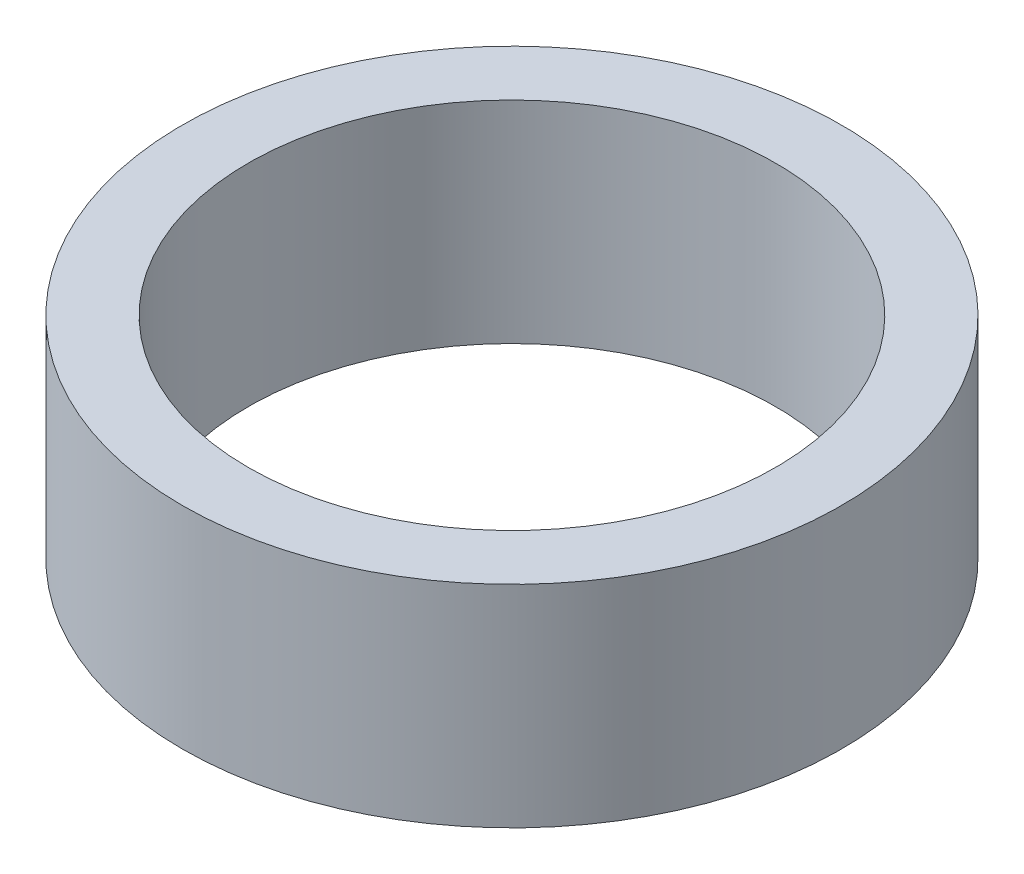
ISO-10303-21;
HEADER;
FILE_DESCRIPTION(('STEP AP214'),'2;1');
FILE_NAME('part.step','',(''),(''),'','','');
FILE_SCHEMA(('AUTOMOTIVE_DESIGN { 1 0 10303 214 1 1 1 1 }'));
ENDSEC;
DATA;
#1=APPLICATION_CONTEXT('core data for automotive mechanical design processes');
#2=APPLICATION_PROTOCOL_DEFINITION('international standard','automotive_design',2000,#1);
#3=PRODUCT_CONTEXT('',#1,'mechanical');
#4=PRODUCT('Part','Part','',(#3));
#5=PRODUCT_RELATED_PRODUCT_CATEGORY('part','',(#4));
#6=PRODUCT_DEFINITION_FORMATION('','',#4);
#7=PRODUCT_DEFINITION_CONTEXT('part definition',#1,'design');
#8=PRODUCT_DEFINITION('design','',#6,#7);
#9=PRODUCT_DEFINITION_SHAPE('','',#8);
#10=(LENGTH_UNIT() NAMED_UNIT(*) SI_UNIT(.MILLI.,.METRE.));
#11=(NAMED_UNIT(*) PLANE_ANGLE_UNIT() SI_UNIT($,.RADIAN.));
#12=(NAMED_UNIT(*) SI_UNIT($,.STERADIAN.) SOLID_ANGLE_UNIT());
#13=UNCERTAINTY_MEASURE_WITH_UNIT(LENGTH_MEASURE(1.E-05),#10,'distance_accuracy_value','');
#14=(GEOMETRIC_REPRESENTATION_CONTEXT(3) GLOBAL_UNCERTAINTY_ASSIGNED_CONTEXT((#13)) GLOBAL_UNIT_ASSIGNED_CONTEXT((#10,
#11,#12)) REPRESENTATION_CONTEXT('',''));
#15=CARTESIAN_POINT('',(0.,0.,0.));
#16=DIRECTION('',(0.,0.,1.));
#17=DIRECTION('',(1.,0.,0.));
#18=AXIS2_PLACEMENT_3D('',#15,#16,#17);
#19=CARTESIAN_POINT('',(0.,24.,0.));
#20=DIRECTION('',(0.,-1.,0.));
#21=DIRECTION('',(0.,0.,-1.));
#22=AXIS2_PLACEMENT_3D('',#19,#20,#21);
#23=CYLINDRICAL_SURFACE('',#22,37.5);
#24=CARTESIAN_POINT('',(0.,24.,0.));
#25=DIRECTION('',(0.,1.,0.));
#26=DIRECTION('',(0.,0.,1.));
#27=AXIS2_PLACEMENT_3D('',#24,#25,#26);
#28=CIRCLE('',#27,37.5);
#29=CARTESIAN_POINT('',(0.,24.,37.5));
#30=VERTEX_POINT('',#29);
#31=EDGE_CURVE('E10',#30,#30,#28,.T.);
#32=ORIENTED_EDGE('',*,*,#31,.F.);
#33=EDGE_LOOP('',(#32));
#34=FACE_BOUND('',#33,.T.);
#35=CARTESIAN_POINT('',(0.,0.,0.));
#36=DIRECTION('',(0.,1.,0.));
#37=DIRECTION('',(0.,0.,1.));
#38=AXIS2_PLACEMENT_3D('',#35,#36,#37);
#39=CIRCLE('',#38,37.5);
#40=CARTESIAN_POINT('',(0.,0.,37.5));
#41=VERTEX_POINT('',#40);
#42=EDGE_CURVE('E37',#41,#41,#39,.T.);
#43=ORIENTED_EDGE('',*,*,#42,.T.);
#44=EDGE_LOOP('',(#43));
#45=FACE_BOUND('',#44,.T.);
#46=ADVANCED_FACE('F40',(#34,#45),#23,.T.);
#47=CARTESIAN_POINT('',(0.,24.,0.));
#48=DIRECTION('',(0.,1.,0.));
#49=DIRECTION('',(0.,0.,1.));
#50=AXIS2_PLACEMENT_3D('',#47,#48,#49);
#51=PLANE('',#50);
#52=CARTESIAN_POINT('',(0.,24.,0.));
#53=DIRECTION('',(0.,1.,0.));
#54=DIRECTION('',(0.,0.,1.));
#55=AXIS2_PLACEMENT_3D('',#52,#53,#54);
#56=CIRCLE('',#55,30.);
#57=CARTESIAN_POINT('',(0.,24.,30.));
#58=VERTEX_POINT('',#57);
#59=EDGE_CURVE('E50',#58,#58,#56,.T.);
#60=ORIENTED_EDGE('',*,*,#59,.F.);
#61=EDGE_LOOP('',(#60));
#62=FACE_BOUND('',#61,.T.);
#63=ORIENTED_EDGE('',*,*,#31,.T.);
#64=EDGE_LOOP('',(#63));
#65=FACE_BOUND('',#64,.T.);
#66=ADVANCED_FACE('F59',(#62,#65),#51,.T.);
#67=CARTESIAN_POINT('',(0.,0.,0.));
#68=DIRECTION('',(0.,1.,0.));
#69=DIRECTION('',(0.,0.,1.));
#70=AXIS2_PLACEMENT_3D('',#67,#68,#69);
#71=PLANE('',#70);
#72=CARTESIAN_POINT('',(0.,0.,0.));
#73=DIRECTION('',(0.,1.,0.));
#74=DIRECTION('',(0.,0.,1.));
#75=AXIS2_PLACEMENT_3D('',#72,#73,#74);
#76=CIRCLE('',#75,30.);
#77=CARTESIAN_POINT('',(0.,0.,30.));
#78=VERTEX_POINT('',#77);
#79=EDGE_CURVE('E47',#78,#78,#76,.T.);
#80=ORIENTED_EDGE('',*,*,#79,.T.);
#81=EDGE_LOOP('',(#80));
#82=FACE_BOUND('',#81,.T.);
#83=ORIENTED_EDGE('',*,*,#42,.F.);
#84=EDGE_LOOP('',(#83));
#85=FACE_BOUND('',#84,.T.);
#86=ADVANCED_FACE('F58',(#82,#85),#71,.F.);
#87=CARTESIAN_POINT('',(0.,24.,0.));
#88=DIRECTION('',(0.,-1.,0.));
#89=DIRECTION('',(0.,0.,-1.));
#90=AXIS2_PLACEMENT_3D('',#87,#88,#89);
#91=CYLINDRICAL_SURFACE('',#90,30.);
#92=ORIENTED_EDGE('',*,*,#59,.T.);
#93=EDGE_LOOP('',(#92));
#94=FACE_BOUND('',#93,.T.);
#95=ORIENTED_EDGE('',*,*,#79,.F.);
#96=EDGE_LOOP('',(#95));
#97=FACE_BOUND('',#96,.T.);
#98=ADVANCED_FACE('F54',(#94,#97),#91,.F.);
#99=CLOSED_SHELL('',(#46,#66,#86,#98));
#100=MANIFOLD_SOLID_BREP('B2',#99);
#101=ADVANCED_BREP_SHAPE_REPRESENTATION('',(#18,#100),#14);
#102=SHAPE_DEFINITION_REPRESENTATION(#9,#101);
ENDSEC;
END-ISO-10303-21;
